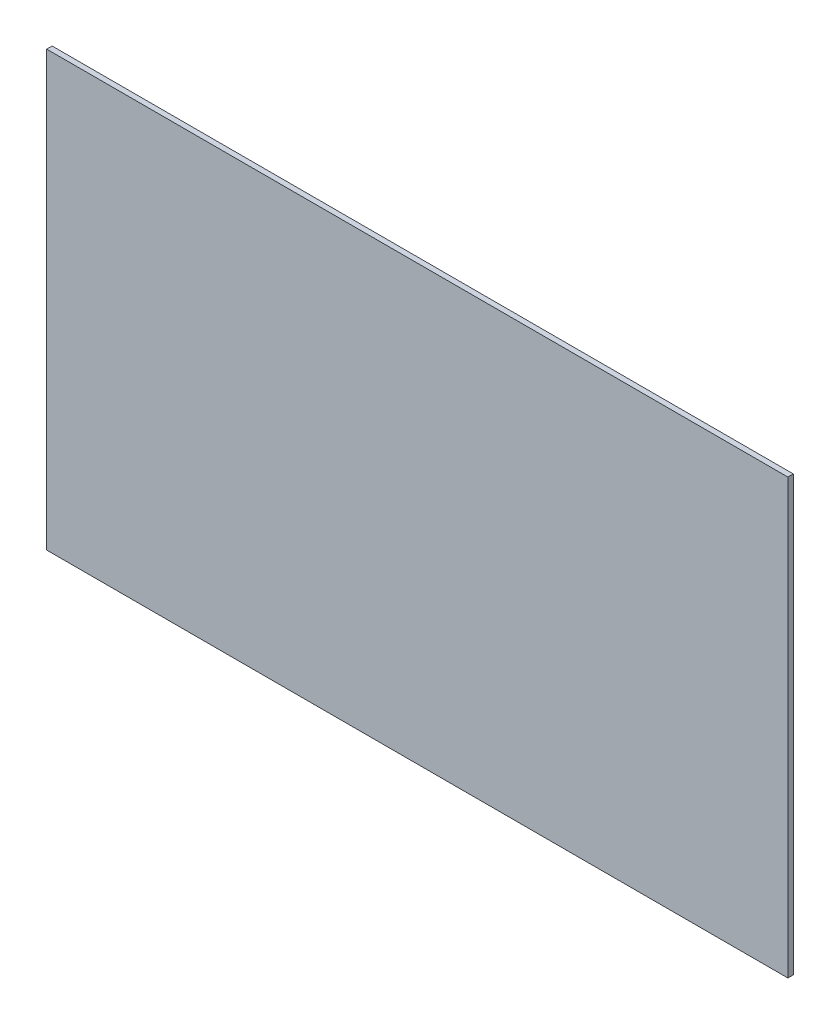
ISO-10303-21;
HEADER;
FILE_DESCRIPTION(('STEP AP214'),'2;1');
FILE_NAME('part.step','',(''),(''),'','','');
FILE_SCHEMA(('AUTOMOTIVE_DESIGN { 1 0 10303 214 1 1 1 1 }'));
ENDSEC;
DATA;
#1=APPLICATION_CONTEXT('core data for automotive mechanical design processes');
#2=APPLICATION_PROTOCOL_DEFINITION('international standard','automotive_design',2000,#1);
#3=PRODUCT_CONTEXT('',#1,'mechanical');
#4=PRODUCT('Part','Part','',(#3));
#5=PRODUCT_RELATED_PRODUCT_CATEGORY('part','',(#4));
#6=PRODUCT_DEFINITION_FORMATION('','',#4);
#7=PRODUCT_DEFINITION_CONTEXT('part definition',#1,'design');
#8=PRODUCT_DEFINITION('design','',#6,#7);
#9=PRODUCT_DEFINITION_SHAPE('','',#8);
#10=(LENGTH_UNIT() NAMED_UNIT(*) SI_UNIT(.MILLI.,.METRE.));
#11=(NAMED_UNIT(*) PLANE_ANGLE_UNIT() SI_UNIT($,.RADIAN.));
#12=(NAMED_UNIT(*) SI_UNIT($,.STERADIAN.) SOLID_ANGLE_UNIT());
#13=UNCERTAINTY_MEASURE_WITH_UNIT(LENGTH_MEASURE(1.E-05),#10,'distance_accuracy_value','');
#14=(GEOMETRIC_REPRESENTATION_CONTEXT(3) GLOBAL_UNCERTAINTY_ASSIGNED_CONTEXT((#13)) GLOBAL_UNIT_ASSIGNED_CONTEXT((#10,
#11,#12)) REPRESENTATION_CONTEXT('',''));
#15=CARTESIAN_POINT('',(0.,0.,0.));
#16=DIRECTION('',(0.,0.,1.));
#17=DIRECTION('',(1.,0.,0.));
#18=AXIS2_PLACEMENT_3D('',#15,#16,#17);
#19=CARTESIAN_POINT('',(205.,-120.,1.5));
#20=DIRECTION('',(-1.,0.,0.));
#21=DIRECTION('',(0.,0.,1.));
#22=AXIS2_PLACEMENT_3D('',#19,#20,#21);
#23=PLANE('',#22);
#24=DIRECTION('',(0.,1.,0.));
#25=VECTOR('',#24,1.);
#26=CARTESIAN_POINT('',(205.,-120.,-1.5));
#27=LINE('',#26,#25);
#28=CARTESIAN_POINT('',(205.,-120.,-1.5));
#29=VERTEX_POINT('',#28);
#30=CARTESIAN_POINT('',(205.,120.,-1.5));
#31=VERTEX_POINT('',#30);
#32=EDGE_CURVE('E100',#29,#31,#27,.T.);
#33=ORIENTED_EDGE('',*,*,#32,.T.);
#34=DIRECTION('',(0.,0.,-1.));
#35=VECTOR('',#34,1.);
#36=CARTESIAN_POINT('',(205.,120.,1.5));
#37=LINE('',#36,#35);
#38=CARTESIAN_POINT('',(205.,120.,1.5));
#39=VERTEX_POINT('',#38);
#40=EDGE_CURVE('E11',#39,#31,#37,.T.);
#41=ORIENTED_EDGE('',*,*,#40,.F.);
#42=DIRECTION('',(0.,1.,0.));
#43=VECTOR('',#42,1.);
#44=CARTESIAN_POINT('',(205.,-120.,1.5));
#45=LINE('',#44,#43);
#46=CARTESIAN_POINT('',(205.,-120.,1.5));
#47=VERTEX_POINT('',#46);
#48=EDGE_CURVE('E88',#47,#39,#45,.T.);
#49=ORIENTED_EDGE('',*,*,#48,.F.);
#50=DIRECTION('',(0.,0.,-1.));
#51=VECTOR('',#50,1.);
#52=CARTESIAN_POINT('',(205.,-120.,1.5));
#53=LINE('',#52,#51);
#54=EDGE_CURVE('E96',#47,#29,#53,.T.);
#55=ORIENTED_EDGE('',*,*,#54,.T.);
#56=EDGE_LOOP('',(#33,#41,#49,#55));
#57=FACE_BOUND('',#56,.T.);
#58=ADVANCED_FACE('F37',(#57),#23,.F.);
#59=CARTESIAN_POINT('',(-205.,120.,1.5));
#60=DIRECTION('',(0.,-1.,0.));
#61=DIRECTION('',(0.,0.,-1.));
#62=AXIS2_PLACEMENT_3D('',#59,#60,#61);
#63=PLANE('',#62);
#64=DIRECTION('',(-1.,0.,0.));
#65=VECTOR('',#64,1.);
#66=CARTESIAN_POINT('',(-205.,120.,-1.5));
#67=LINE('',#66,#65);
#68=CARTESIAN_POINT('',(-205.,120.,-1.5));
#69=VERTEX_POINT('',#68);
#70=EDGE_CURVE('E92',#31,#69,#67,.T.);
#71=ORIENTED_EDGE('',*,*,#70,.T.);
#72=DIRECTION('',(0.,0.,-1.));
#73=VECTOR('',#72,1.);
#74=CARTESIAN_POINT('',(-205.,120.,1.5));
#75=LINE('',#74,#73);
#76=CARTESIAN_POINT('',(-205.,120.,1.5));
#77=VERTEX_POINT('',#76);
#78=EDGE_CURVE('E45',#77,#69,#75,.T.);
#79=ORIENTED_EDGE('',*,*,#78,.F.);
#80=DIRECTION('',(-1.,0.,0.));
#81=VECTOR('',#80,1.);
#82=CARTESIAN_POINT('',(-205.,120.,1.5));
#83=LINE('',#82,#81);
#84=EDGE_CURVE('E83',#39,#77,#83,.T.);
#85=ORIENTED_EDGE('',*,*,#84,.F.);
#86=ORIENTED_EDGE('',*,*,#40,.T.);
#87=EDGE_LOOP('',(#71,#79,#85,#86));
#88=FACE_BOUND('',#87,.T.);
#89=ADVANCED_FACE('F91',(#88),#63,.F.);
#90=CARTESIAN_POINT('',(-205.,-120.,1.5));
#91=DIRECTION('',(1.,0.,0.));
#92=DIRECTION('',(0.,0.,-1.));
#93=AXIS2_PLACEMENT_3D('',#90,#91,#92);
#94=PLANE('',#93);
#95=DIRECTION('',(0.,-1.,0.));
#96=VECTOR('',#95,1.);
#97=CARTESIAN_POINT('',(-205.,-120.,-1.5));
#98=LINE('',#97,#96);
#99=CARTESIAN_POINT('',(-205.,-120.,-1.5));
#100=VERTEX_POINT('',#99);
#101=EDGE_CURVE('E70',#69,#100,#98,.T.);
#102=ORIENTED_EDGE('',*,*,#101,.T.);
#103=DIRECTION('',(0.,0.,-1.));
#104=VECTOR('',#103,1.);
#105=CARTESIAN_POINT('',(-205.,-120.,1.5));
#106=LINE('',#105,#104);
#107=CARTESIAN_POINT('',(-205.,-120.,1.5));
#108=VERTEX_POINT('',#107);
#109=EDGE_CURVE('E93',#108,#100,#106,.T.);
#110=ORIENTED_EDGE('',*,*,#109,.F.);
#111=DIRECTION('',(0.,-1.,0.));
#112=VECTOR('',#111,1.);
#113=CARTESIAN_POINT('',(-205.,-120.,1.5));
#114=LINE('',#113,#112);
#115=EDGE_CURVE('E86',#77,#108,#114,.T.);
#116=ORIENTED_EDGE('',*,*,#115,.F.);
#117=ORIENTED_EDGE('',*,*,#78,.T.);
#118=EDGE_LOOP('',(#102,#110,#116,#117));
#119=FACE_BOUND('',#118,.T.);
#120=ADVANCED_FACE('F94',(#119),#94,.F.);
#121=CARTESIAN_POINT('',(-205.,-120.,1.5));
#122=DIRECTION('',(0.,1.,0.));
#123=DIRECTION('',(0.,0.,1.));
#124=AXIS2_PLACEMENT_3D('',#121,#122,#123);
#125=PLANE('',#124);
#126=DIRECTION('',(1.,0.,0.));
#127=VECTOR('',#126,1.);
#128=CARTESIAN_POINT('',(-205.,-120.,-1.5));
#129=LINE('',#128,#127);
#130=EDGE_CURVE('E76',#100,#29,#129,.T.);
#131=ORIENTED_EDGE('',*,*,#130,.T.);
#132=ORIENTED_EDGE('',*,*,#54,.F.);
#133=DIRECTION('',(1.,0.,0.));
#134=VECTOR('',#133,1.);
#135=CARTESIAN_POINT('',(-205.,-120.,1.5));
#136=LINE('',#135,#134);
#137=EDGE_CURVE('E53',#108,#47,#136,.T.);
#138=ORIENTED_EDGE('',*,*,#137,.F.);
#139=ORIENTED_EDGE('',*,*,#109,.T.);
#140=EDGE_LOOP('',(#131,#132,#138,#139));
#141=FACE_BOUND('',#140,.T.);
#142=ADVANCED_FACE('F107',(#141),#125,.F.);
#143=CARTESIAN_POINT('',(0.,0.,1.5));
#144=DIRECTION('',(0.,0.,-1.));
#145=DIRECTION('',(-1.,0.,0.));
#146=AXIS2_PLACEMENT_3D('',#143,#144,#145);
#147=PLANE('',#146);
#148=ORIENTED_EDGE('',*,*,#48,.T.);
#149=ORIENTED_EDGE('',*,*,#84,.T.);
#150=ORIENTED_EDGE('',*,*,#115,.T.);
#151=ORIENTED_EDGE('',*,*,#137,.T.);
#152=EDGE_LOOP('',(#148,#149,#150,#151));
#153=FACE_BOUND('',#152,.T.);
#154=ADVANCED_FACE('F84',(#153),#147,.F.);
#155=CARTESIAN_POINT('',(0.,0.,-1.5));
#156=DIRECTION('',(0.,0.,-1.));
#157=DIRECTION('',(-1.,0.,0.));
#158=AXIS2_PLACEMENT_3D('',#155,#156,#157);
#159=PLANE('',#158);
#160=ORIENTED_EDGE('',*,*,#32,.F.);
#161=ORIENTED_EDGE('',*,*,#130,.F.);
#162=ORIENTED_EDGE('',*,*,#101,.F.);
#163=ORIENTED_EDGE('',*,*,#70,.F.);
#164=EDGE_LOOP('',(#160,#161,#162,#163));
#165=FACE_BOUND('',#164,.T.);
#166=ADVANCED_FACE('F110',(#165),#159,.T.);
#167=CLOSED_SHELL('',(#58,#89,#120,#142,#154,#166));
#168=MANIFOLD_SOLID_BREP('B2',#167);
#169=ADVANCED_BREP_SHAPE_REPRESENTATION('',(#18,#168),#14);
#170=SHAPE_DEFINITION_REPRESENTATION(#9,#169);
ENDSEC;
END-ISO-10303-21;
